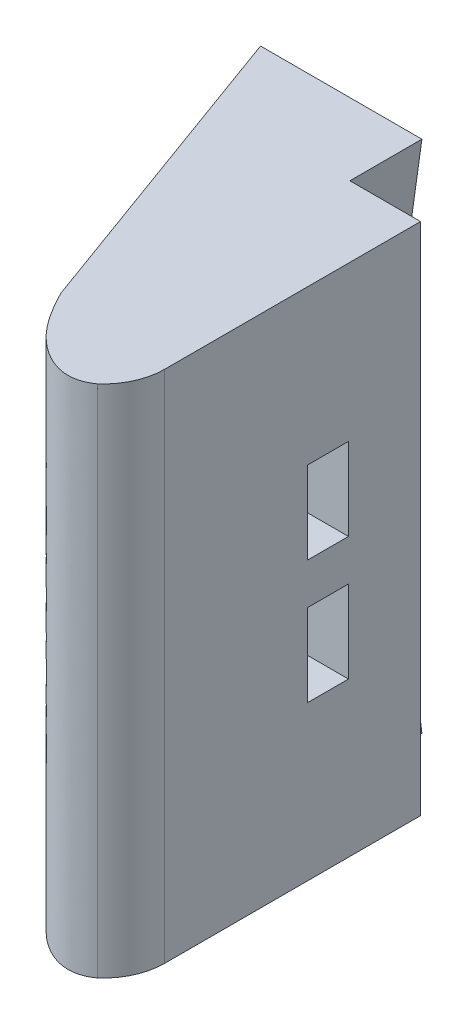
ISO-10303-21;
HEADER;
FILE_DESCRIPTION(('STEP AP214'),'2;1');
FILE_NAME('part.step','',(''),(''),'','','');
FILE_SCHEMA(('AUTOMOTIVE_DESIGN { 1 0 10303 214 1 1 1 1 }'));
ENDSEC;
DATA;
#1=APPLICATION_CONTEXT('core data for automotive mechanical design processes');
#2=APPLICATION_PROTOCOL_DEFINITION('international standard','automotive_design',2000,#1);
#3=PRODUCT_CONTEXT('',#1,'mechanical');
#4=PRODUCT('Part','Part','',(#3));
#5=PRODUCT_RELATED_PRODUCT_CATEGORY('part','',(#4));
#6=PRODUCT_DEFINITION_FORMATION('','',#4);
#7=PRODUCT_DEFINITION_CONTEXT('part definition',#1,'design');
#8=PRODUCT_DEFINITION('design','',#6,#7);
#9=PRODUCT_DEFINITION_SHAPE('','',#8);
#10=(LENGTH_UNIT() NAMED_UNIT(*) SI_UNIT(.MILLI.,.METRE.));
#11=(NAMED_UNIT(*) PLANE_ANGLE_UNIT() SI_UNIT($,.RADIAN.));
#12=(NAMED_UNIT(*) SI_UNIT($,.STERADIAN.) SOLID_ANGLE_UNIT());
#13=UNCERTAINTY_MEASURE_WITH_UNIT(LENGTH_MEASURE(1.E-05),#10,'distance_accuracy_value','');
#14=(GEOMETRIC_REPRESENTATION_CONTEXT(3) GLOBAL_UNCERTAINTY_ASSIGNED_CONTEXT((#13)) GLOBAL_UNIT_ASSIGNED_CONTEXT((#10,
#11,#12)) REPRESENTATION_CONTEXT('',''));
#15=CARTESIAN_POINT('',(0.,0.,0.));
#16=DIRECTION('',(0.,0.,1.));
#17=DIRECTION('',(1.,0.,0.));
#18=AXIS2_PLACEMENT_3D('',#15,#16,#17);
#19=CARTESIAN_POINT('',(0.,50.,0.));
#20=DIRECTION('',(0.,0.,-1.));
#21=DIRECTION('',(-1.,0.,0.));
#22=AXIS2_PLACEMENT_3D('',#19,#20,#21);
#23=PLANE('',#22);
#24=CARTESIAN_POINT('',(14.,31.,0.));
#25=DIRECTION('',(0.,0.,-1.));
#26=DIRECTION('',(-1.,0.,0.));
#27=AXIS2_PLACEMENT_3D('',#24,#25,#26);
#28=CIRCLE('',#27,1.6);
#29=CARTESIAN_POINT('',(12.4,31.,0.));
#30=VERTEX_POINT('',#29);
#31=EDGE_CURVE('E300',#30,#30,#28,.T.);
#32=ORIENTED_EDGE('',*,*,#31,.F.);
#33=EDGE_LOOP('',(#32));
#34=FACE_BOUND('',#33,.T.);
#35=CARTESIAN_POINT('',(14.,19.,0.));
#36=DIRECTION('',(0.,0.,-1.));
#37=DIRECTION('',(1.,0.,0.));
#38=AXIS2_PLACEMENT_3D('',#35,#36,#37);
#39=CIRCLE('',#38,1.6);
#40=CARTESIAN_POINT('',(15.6,19.,0.));
#41=VERTEX_POINT('',#40);
#42=EDGE_CURVE('E306',#41,#41,#39,.T.);
#43=ORIENTED_EDGE('',*,*,#42,.F.);
#44=EDGE_LOOP('',(#43));
#45=FACE_BOUND('',#44,.T.);
#46=DIRECTION('',(0.,-1.,0.));
#47=VECTOR('',#46,1.);
#48=CARTESIAN_POINT('',(0.,50.,0.));
#49=LINE('',#48,#47);
#50=CARTESIAN_POINT('',(0.,37.4287142658096,0.));
#51=VERTEX_POINT('',#50);
#52=CARTESIAN_POINT('',(0.,12.5712857341904,0.));
#53=VERTEX_POINT('',#52);
#54=EDGE_CURVE('E205',#51,#53,#49,.T.);
#55=ORIENTED_EDGE('',*,*,#54,.F.);
#56=DIRECTION('',(-1.,0.,0.));
#57=VECTOR('',#56,1.);
#58=CARTESIAN_POINT('',(0.,37.4287142658096,0.));
#59=LINE('',#58,#57);
#60=CARTESIAN_POINT('',(11.3691003651649,37.4287142658096,0.));
#61=VERTEX_POINT('',#60);
#62=EDGE_CURVE('E61',#61,#51,#59,.T.);
#63=ORIENTED_EDGE('',*,*,#62,.F.);
#64=DIRECTION('',(-0.139173100960059,-0.990268068741571,0.));
#65=VECTOR('',#64,1.);
#66=CARTESIAN_POINT('',(11.3691003651649,37.4287142658096,0.));
#67=LINE('',#66,#65);
#68=CARTESIAN_POINT('',(13.1358793555302,50.,0.));
#69=VERTEX_POINT('',#68);
#70=EDGE_CURVE('E449',#69,#61,#67,.T.);
#71=ORIENTED_EDGE('',*,*,#70,.F.);
#72=DIRECTION('',(1.,0.,0.));
#73=VECTOR('',#72,1.);
#74=CARTESIAN_POINT('',(0.,50.,0.));
#75=LINE('',#74,#73);
#76=CARTESIAN_POINT('',(20.,50.,0.));
#77=VERTEX_POINT('',#76);
#78=EDGE_CURVE('E324',#69,#77,#75,.T.);
#79=ORIENTED_EDGE('',*,*,#78,.T.);
#80=DIRECTION('',(0.,-1.,0.));
#81=VECTOR('',#80,1.);
#82=CARTESIAN_POINT('',(20.,50.,0.));
#83=LINE('',#82,#81);
#84=CARTESIAN_POINT('',(20.,0.,0.));
#85=VERTEX_POINT('',#84);
#86=EDGE_CURVE('E348',#77,#85,#83,.T.);
#87=ORIENTED_EDGE('',*,*,#86,.T.);
#88=DIRECTION('',(1.,0.,0.));
#89=VECTOR('',#88,1.);
#90=CARTESIAN_POINT('',(0.,0.,0.));
#91=LINE('',#90,#89);
#92=CARTESIAN_POINT('',(13.1358793555302,0.,0.));
#93=VERTEX_POINT('',#92);
#94=EDGE_CURVE('E342',#93,#85,#91,.T.);
#95=ORIENTED_EDGE('',*,*,#94,.F.);
#96=DIRECTION('',(0.139173100960073,-0.990268068741569,0.));
#97=VECTOR('',#96,1.);
#98=CARTESIAN_POINT('',(12.7608313747655,2.66860504677466,0.));
#99=LINE('',#98,#97);
#100=CARTESIAN_POINT('',(11.3691003651649,12.5712857341904,0.));
#101=VERTEX_POINT('',#100);
#102=EDGE_CURVE('E211',#101,#93,#99,.T.);
#103=ORIENTED_EDGE('',*,*,#102,.F.);
#104=DIRECTION('',(1.,0.,0.));
#105=VECTOR('',#104,1.);
#106=CARTESIAN_POINT('',(0.,12.5712857341904,0.));
#107=LINE('',#106,#105);
#108=EDGE_CURVE('E207',#53,#101,#107,.T.);
#109=ORIENTED_EDGE('',*,*,#108,.F.);
#110=EDGE_LOOP('',(#55,#63,#71,#79,#87,#95,#103,#109));
#111=FACE_BOUND('',#110,.T.);
#112=ADVANCED_FACE('F35',(#34,#45,#111),#23,.T.);
#113=CARTESIAN_POINT('',(14.,19.,20.));
#114=DIRECTION('',(0.,0.,-1.));
#115=DIRECTION('',(-1.,0.,0.));
#116=AXIS2_PLACEMENT_3D('',#113,#114,#115);
#117=CYLINDRICAL_SURFACE('',#116,1.6);
#118=CARTESIAN_POINT('',(14.,19.,7.));
#119=DIRECTION('',(0.,0.,-1.));
#120=DIRECTION('',(-1.,0.,0.));
#121=AXIS2_PLACEMENT_3D('',#118,#119,#120);
#122=CIRCLE('',#121,1.6);
#123=CARTESIAN_POINT('',(12.4,19.,7.));
#124=VERTEX_POINT('',#123);
#125=EDGE_CURVE('E40',#124,#124,#122,.F.);
#126=ORIENTED_EDGE('',*,*,#125,.T.);
#127=EDGE_LOOP('',(#126));
#128=FACE_BOUND('',#127,.T.);
#129=ORIENTED_EDGE('',*,*,#42,.T.);
#130=EDGE_LOOP('',(#129));
#131=FACE_BOUND('',#130,.T.);
#132=ADVANCED_FACE('F363',(#128,#131),#117,.F.);
#133=CARTESIAN_POINT('',(14.,31.,20.));
#134=DIRECTION('',(0.,0.,-1.));
#135=DIRECTION('',(-1.,0.,0.));
#136=AXIS2_PLACEMENT_3D('',#133,#134,#135);
#137=CYLINDRICAL_SURFACE('',#136,1.6);
#138=CARTESIAN_POINT('',(14.,31.,7.));
#139=DIRECTION('',(0.,0.,-1.));
#140=DIRECTION('',(-1.,0.,0.));
#141=AXIS2_PLACEMENT_3D('',#138,#139,#140);
#142=CIRCLE('',#141,1.6);
#143=CARTESIAN_POINT('',(12.4,31.,7.));
#144=VERTEX_POINT('',#143);
#145=EDGE_CURVE('E354',#144,#144,#142,.F.);
#146=ORIENTED_EDGE('',*,*,#145,.T.);
#147=EDGE_LOOP('',(#146));
#148=FACE_BOUND('',#147,.T.);
#149=ORIENTED_EDGE('',*,*,#31,.T.);
#150=EDGE_LOOP('',(#149));
#151=FACE_BOUND('',#150,.T.);
#152=ADVANCED_FACE('F390',(#148,#151),#137,.F.);
#153=CARTESIAN_POINT('',(17.9735954047257,50.,29.3468038901052));
#154=CARTESIAN_POINT('',(16.281120610665,50.,30.6016749504074));
#155=CARTESIAN_POINT('',(11.8763529202722,50.,29.3199048218283));
#156=CARTESIAN_POINT('',(9.5982313957707,50.,25.5615951303054));
#157=CARTESIAN_POINT('',(8.55050358314165,50.,23.4923155196477));
#158=B_SPLINE_CURVE_WITH_KNOTS('',3,(#153,#154,#155,#156,#157),.UNSPECIFIED.,.F.,.F.,(4,1,4),
(0.,0.430742710905784,1.),.UNSPECIFIED.);
#159=DIRECTION('',(0.,-1.,0.));
#160=VECTOR('',#159,1.);
#161=SURFACE_OF_LINEAR_EXTRUSION('',#158,#160);
#162=CARTESIAN_POINT('',(17.9735954047257,0.,29.3468038901052));
#163=CARTESIAN_POINT('',(16.281120610665,0.,30.6016749504074));
#164=CARTESIAN_POINT('',(11.8763529202722,0.,29.3199048218283));
#165=CARTESIAN_POINT('',(9.5982313957707,0.,25.5615951303054));
#166=CARTESIAN_POINT('',(8.55050358314165,0.,23.4923155196477));
#167=B_SPLINE_CURVE_WITH_KNOTS('',3,(#162,#163,#164,#165,#166),.UNSPECIFIED.,.F.,.F.,(4,1,4),
(0.,0.430742710905784,1.),.UNSPECIFIED.);
#168=CARTESIAN_POINT('',(17.9735954047257,0.,29.3468038901052));
#169=VERTEX_POINT('',#168);
#170=CARTESIAN_POINT('',(8.55050358314165,0.,23.4923155196477));
#171=VERTEX_POINT('',#170);
#172=EDGE_CURVE('E299',#169,#171,#167,.T.);
#173=ORIENTED_EDGE('',*,*,#172,.F.);
#174=DIRECTION('',(0.,-1.,0.));
#175=VECTOR('',#174,1.);
#176=CARTESIAN_POINT('',(17.9735954047257,50.,29.3468038901052));
#177=LINE('',#176,#175);
#178=CARTESIAN_POINT('',(17.9735954047257,50.,29.3468038901052));
#179=VERTEX_POINT('',#178);
#180=EDGE_CURVE('E11',#179,#169,#177,.T.);
#181=ORIENTED_EDGE('',*,*,#180,.F.);
#182=CARTESIAN_POINT('',(8.55050358314165,50.,23.4923155196477));
#183=VERTEX_POINT('',#182);
#184=EDGE_CURVE('E308',#179,#183,#158,.T.);
#185=ORIENTED_EDGE('',*,*,#184,.T.);
#186=DIRECTION('',(0.,-1.,0.));
#187=VECTOR('',#186,1.);
#188=CARTESIAN_POINT('',(8.55050358314165,50.,23.4923155196477));
#189=LINE('',#188,#187);
#190=EDGE_CURVE('E328',#183,#171,#189,.T.);
#191=ORIENTED_EDGE('',*,*,#190,.T.);
#192=EDGE_LOOP('',(#173,#181,#185,#191));
#193=FACE_BOUND('',#192,.T.);
#194=ADVANCED_FACE('F37',(#193),#161,.T.);
#195=CARTESIAN_POINT('',(14.01,50.,24.8557002988219));
#196=DIRECTION('',(0.,-1.,0.));
#197=DIRECTION('',(0.,0.,-1.));
#198=AXIS2_PLACEMENT_3D('',#195,#196,#197);
#199=CYLINDRICAL_SURFACE('',#198,5.99);
#200=CARTESIAN_POINT('',(14.01,0.,24.8557002988219));
#201=DIRECTION('',(0.,1.,0.));
#202=DIRECTION('',(0.,0.,1.));
#203=AXIS2_PLACEMENT_3D('',#200,#201,#202);
#204=CIRCLE('',#203,5.99);
#205=CARTESIAN_POINT('',(20.,0.,24.8557002988219));
#206=VERTEX_POINT('',#205);
#207=EDGE_CURVE('E333',#206,#169,#204,.F.);
#208=ORIENTED_EDGE('',*,*,#207,.F.);
#209=DIRECTION('',(0.,-1.,0.));
#210=VECTOR('',#209,1.);
#211=CARTESIAN_POINT('',(20.,50.,24.8557002988219));
#212=LINE('',#211,#210);
#213=CARTESIAN_POINT('',(20.,50.,24.8557002988219));
#214=VERTEX_POINT('',#213);
#215=EDGE_CURVE('E45',#214,#206,#212,.T.);
#216=ORIENTED_EDGE('',*,*,#215,.F.);
#217=CARTESIAN_POINT('',(14.01,50.,24.8557002988219));
#218=DIRECTION('',(0.,1.,0.));
#219=DIRECTION('',(0.,0.,1.));
#220=AXIS2_PLACEMENT_3D('',#217,#218,#219);
#221=CIRCLE('',#220,5.99);
#222=EDGE_CURVE('E314',#214,#179,#221,.F.);
#223=ORIENTED_EDGE('',*,*,#222,.T.);
#224=ORIENTED_EDGE('',*,*,#180,.T.);
#225=EDGE_LOOP('',(#208,#216,#223,#224));
#226=FACE_BOUND('',#225,.T.);
#227=ADVANCED_FACE('F400',(#226),#199,.T.);
#228=CARTESIAN_POINT('',(20.,50.,0.));
#229=DIRECTION('',(1.,0.,0.));
#230=DIRECTION('',(0.,0.,-1.));
#231=AXIS2_PLACEMENT_3D('',#228,#229,#230);
#232=PLANE('',#231);
#233=DIRECTION('',(0.,1.,0.));
#234=VECTOR('',#233,1.);
#235=CARTESIAN_POINT('',(20.,27.,7.));
#236=LINE('',#235,#234);
#237=CARTESIAN_POINT('',(20.,27.,7.));
#238=VERTEX_POINT('',#237);
#239=CARTESIAN_POINT('',(20.,35.,7.));
#240=VERTEX_POINT('',#239);
#241=EDGE_CURVE('E246',#238,#240,#236,.T.);
#242=ORIENTED_EDGE('',*,*,#241,.F.);
#243=DIRECTION('',(0.,0.,-1.));
#244=VECTOR('',#243,1.);
#245=CARTESIAN_POINT('',(20.,27.,7.));
#246=LINE('',#245,#244);
#247=CARTESIAN_POINT('',(20.,27.,11.));
#248=VERTEX_POINT('',#247);
#249=EDGE_CURVE('E236',#248,#238,#246,.T.);
#250=ORIENTED_EDGE('',*,*,#249,.F.);
#251=DIRECTION('',(0.,-1.,0.));
#252=VECTOR('',#251,1.);
#253=CARTESIAN_POINT('',(20.,27.,11.));
#254=LINE('',#253,#252);
#255=CARTESIAN_POINT('',(20.,35.,11.));
#256=VERTEX_POINT('',#255);
#257=EDGE_CURVE('E252',#256,#248,#254,.T.);
#258=ORIENTED_EDGE('',*,*,#257,.F.);
#259=DIRECTION('',(0.,0.,1.));
#260=VECTOR('',#259,1.);
#261=CARTESIAN_POINT('',(20.,35.,7.));
#262=LINE('',#261,#260);
#263=EDGE_CURVE('E248',#240,#256,#262,.T.);
#264=ORIENTED_EDGE('',*,*,#263,.F.);
#265=EDGE_LOOP('',(#242,#250,#258,#264));
#266=FACE_BOUND('',#265,.T.);
#267=DIRECTION('',(0.,1.,0.));
#268=VECTOR('',#267,1.);
#269=CARTESIAN_POINT('',(20.,23.,7.));
#270=LINE('',#269,#268);
#271=CARTESIAN_POINT('',(20.,15.,7.));
#272=VERTEX_POINT('',#271);
#273=CARTESIAN_POINT('',(20.,23.,7.));
#274=VERTEX_POINT('',#273);
#275=EDGE_CURVE('E231',#272,#274,#270,.T.);
#276=ORIENTED_EDGE('',*,*,#275,.F.);
#277=DIRECTION('',(0.,0.,-1.));
#278=VECTOR('',#277,1.);
#279=CARTESIAN_POINT('',(20.,15.,7.));
#280=LINE('',#279,#278);
#281=CARTESIAN_POINT('',(20.,15.,11.));
#282=VERTEX_POINT('',#281);
#283=EDGE_CURVE('E270',#282,#272,#280,.T.);
#284=ORIENTED_EDGE('',*,*,#283,.F.);
#285=DIRECTION('',(0.,-1.,0.));
#286=VECTOR('',#285,1.);
#287=CARTESIAN_POINT('',(20.,23.,11.));
#288=LINE('',#287,#286);
#289=CARTESIAN_POINT('',(20.,23.,11.));
#290=VERTEX_POINT('',#289);
#291=EDGE_CURVE('E284',#290,#282,#288,.T.);
#292=ORIENTED_EDGE('',*,*,#291,.F.);
#293=DIRECTION('',(0.,0.,1.));
#294=VECTOR('',#293,1.);
#295=CARTESIAN_POINT('',(20.,23.,7.));
#296=LINE('',#295,#294);
#297=EDGE_CURVE('E281',#274,#290,#296,.T.);
#298=ORIENTED_EDGE('',*,*,#297,.F.);
#299=EDGE_LOOP('',(#276,#284,#292,#298));
#300=FACE_BOUND('',#299,.T.);
#301=DIRECTION('',(0.,0.,1.));
#302=VECTOR('',#301,1.);
#303=CARTESIAN_POINT('',(20.,0.,0.));
#304=LINE('',#303,#302);
#305=EDGE_CURVE('E339',#85,#206,#304,.T.);
#306=ORIENTED_EDGE('',*,*,#305,.F.);
#307=ORIENTED_EDGE('',*,*,#86,.F.);
#308=DIRECTION('',(0.,0.,1.));
#309=VECTOR('',#308,1.);
#310=CARTESIAN_POINT('',(20.,50.,0.));
#311=LINE('',#310,#309);
#312=EDGE_CURVE('E321',#77,#214,#311,.T.);
#313=ORIENTED_EDGE('',*,*,#312,.T.);
#314=ORIENTED_EDGE('',*,*,#215,.T.);
#315=EDGE_LOOP('',(#306,#307,#313,#314));
#316=FACE_BOUND('',#315,.T.);
#317=ADVANCED_FACE('F398',(#266,#300,#316),#232,.T.);
#318=CARTESIAN_POINT('',(0.,50.,0.));
#319=DIRECTION('',(0.939692620785909,0.,-0.342020143325666));
#320=DIRECTION('',(-0.342020143325666,0.,-0.93969262078591));
#321=AXIS2_PLACEMENT_3D('',#318,#319,#320);
#322=PLANE('',#321);
#323=DIRECTION('',(0.342020143325666,0.,0.93969262078591));
#324=VECTOR('',#323,1.);
#325=CARTESIAN_POINT('',(0.,0.,0.));
#326=LINE('',#325,#324);
#327=CARTESIAN_POINT('',(-2.54779163986337,0.,-7.));
#328=VERTEX_POINT('',#327);
#329=EDGE_CURVE('E315',#328,#171,#326,.T.);
#330=ORIENTED_EDGE('',*,*,#329,.T.);
#331=ORIENTED_EDGE('',*,*,#190,.F.);
#332=DIRECTION('',(0.342020143325666,0.,0.93969262078591));
#333=VECTOR('',#332,1.);
#334=CARTESIAN_POINT('',(0.,50.,0.));
#335=LINE('',#334,#333);
#336=CARTESIAN_POINT('',(-2.54779163986337,50.,-7.));
#337=VERTEX_POINT('',#336);
#338=EDGE_CURVE('E326',#337,#183,#335,.T.);
#339=ORIENTED_EDGE('',*,*,#338,.F.);
#340=DIRECTION('',(0.,1.,0.));
#341=VECTOR('',#340,1.);
#342=CARTESIAN_POINT('',(-2.54779163986337,37.43,-7.));
#343=LINE('',#342,#341);
#344=CARTESIAN_POINT('',(-2.54779163986337,37.43,-7.));
#345=VERTEX_POINT('',#344);
#346=EDGE_CURVE('E442',#345,#337,#343,.T.);
#347=ORIENTED_EDGE('',*,*,#346,.F.);
#348=DIRECTION('',(0.342020143325663,0.,0.939692620785911));
#349=VECTOR('',#348,1.);
#350=CARTESIAN_POINT('',(-2.54779163986337,37.43,-7.));
#351=LINE('',#350,#349);
#352=CARTESIAN_POINT('',(0.,37.43,0.));
#353=VERTEX_POINT('',#352);
#354=EDGE_CURVE('E430',#345,#353,#351,.T.);
#355=ORIENTED_EDGE('',*,*,#354,.T.);
#356=EDGE_CURVE('E346',#353,#51,#49,.T.);
#357=ORIENTED_EDGE('',*,*,#356,.T.);
#358=ORIENTED_EDGE('',*,*,#54,.T.);
#359=DIRECTION('',(0.,1.,0.));
#360=VECTOR('',#359,1.);
#361=CARTESIAN_POINT('',(0.,0.,0.));
#362=LINE('',#361,#360);
#363=CARTESIAN_POINT('',(0.,12.57,0.));
#364=VERTEX_POINT('',#363);
#365=EDGE_CURVE('E199',#364,#53,#362,.T.);
#366=ORIENTED_EDGE('',*,*,#365,.F.);
#367=DIRECTION('',(-0.342020143325665,0.,-0.93969262078591));
#368=VECTOR('',#367,1.);
#369=CARTESIAN_POINT('',(0.,12.57,0.));
#370=LINE('',#369,#368);
#371=CARTESIAN_POINT('',(-2.54779163986337,12.57,-7.));
#372=VERTEX_POINT('',#371);
#373=EDGE_CURVE('E187',#364,#372,#370,.T.);
#374=ORIENTED_EDGE('',*,*,#373,.T.);
#375=DIRECTION('',(0.,-1.,0.));
#376=VECTOR('',#375,1.);
#377=CARTESIAN_POINT('',(-2.54779163986337,12.57,-7.));
#378=LINE('',#377,#376);
#379=EDGE_CURVE('E426',#372,#328,#378,.T.);
#380=ORIENTED_EDGE('',*,*,#379,.T.);
#381=EDGE_LOOP('',(#330,#331,#339,#347,#355,#357,#358,#366,#374,#380));
#382=FACE_BOUND('',#381,.T.);
#383=ADVANCED_FACE('F204',(#382),#322,.F.);
#384=CARTESIAN_POINT('',(0.,50.,0.));
#385=DIRECTION('',(0.,1.,0.));
#386=DIRECTION('',(0.,0.,1.));
#387=AXIS2_PLACEMENT_3D('',#384,#385,#386);
#388=PLANE('',#387);
#389=ORIENTED_EDGE('',*,*,#184,.F.);
#390=ORIENTED_EDGE('',*,*,#222,.F.);
#391=ORIENTED_EDGE('',*,*,#312,.F.);
#392=ORIENTED_EDGE('',*,*,#78,.F.);
#393=DIRECTION('',(0.,0.,1.));
#394=VECTOR('',#393,1.);
#395=CARTESIAN_POINT('',(13.1358793555302,50.,-7.));
#396=LINE('',#395,#394);
#397=CARTESIAN_POINT('',(13.1358793555302,50.,-7.));
#398=VERTEX_POINT('',#397);
#399=EDGE_CURVE('E214',#398,#69,#396,.T.);
#400=ORIENTED_EDGE('',*,*,#399,.F.);
#401=DIRECTION('',(1.,0.,0.));
#402=VECTOR('',#401,1.);
#403=CARTESIAN_POINT('',(13.1358793555302,50.,-7.));
#404=LINE('',#403,#402);
#405=EDGE_CURVE('E452',#337,#398,#404,.T.);
#406=ORIENTED_EDGE('',*,*,#405,.F.);
#407=ORIENTED_EDGE('',*,*,#338,.T.);
#408=EDGE_LOOP('',(#389,#390,#391,#392,#400,#406,#407));
#409=FACE_BOUND('',#408,.T.);
#410=ADVANCED_FACE('F419',(#409),#388,.T.);
#411=CARTESIAN_POINT('',(0.,0.,0.));
#412=DIRECTION('',(0.,1.,0.));
#413=DIRECTION('',(0.,0.,1.));
#414=AXIS2_PLACEMENT_3D('',#411,#412,#413);
#415=PLANE('',#414);
#416=ORIENTED_EDGE('',*,*,#172,.T.);
#417=ORIENTED_EDGE('',*,*,#329,.F.);
#418=DIRECTION('',(-1.,0.,0.));
#419=VECTOR('',#418,1.);
#420=CARTESIAN_POINT('',(13.1358793555302,0.,-7.));
#421=LINE('',#420,#419);
#422=CARTESIAN_POINT('',(13.1358793555302,0.,-7.));
#423=VERTEX_POINT('',#422);
#424=EDGE_CURVE('E217',#423,#328,#421,.T.);
#425=ORIENTED_EDGE('',*,*,#424,.F.);
#426=DIRECTION('',(0.,0.,1.));
#427=VECTOR('',#426,1.);
#428=CARTESIAN_POINT('',(13.1358793555302,0.,-7.));
#429=LINE('',#428,#427);
#430=EDGE_CURVE('E222',#423,#93,#429,.T.);
#431=ORIENTED_EDGE('',*,*,#430,.T.);
#432=ORIENTED_EDGE('',*,*,#94,.T.);
#433=ORIENTED_EDGE('',*,*,#305,.T.);
#434=ORIENTED_EDGE('',*,*,#207,.T.);
#435=EDGE_LOOP('',(#416,#417,#425,#431,#432,#433,#434));
#436=FACE_BOUND('',#435,.T.);
#437=ADVANCED_FACE('F413',(#436),#415,.F.);
#438=CARTESIAN_POINT('',(8.,27.,7.));
#439=DIRECTION('',(0.,0.,-1.));
#440=DIRECTION('',(-1.,0.,0.));
#441=AXIS2_PLACEMENT_3D('',#438,#439,#440);
#442=PLANE('',#441);
#443=ORIENTED_EDGE('',*,*,#241,.T.);
#444=DIRECTION('',(1.,0.,0.));
#445=VECTOR('',#444,1.);
#446=CARTESIAN_POINT('',(8.,35.,7.));
#447=LINE('',#446,#445);
#448=CARTESIAN_POINT('',(8.,35.,7.));
#449=VERTEX_POINT('',#448);
#450=EDGE_CURVE('E245',#449,#240,#447,.T.);
#451=ORIENTED_EDGE('',*,*,#450,.F.);
#452=DIRECTION('',(0.,1.,0.));
#453=VECTOR('',#452,1.);
#454=CARTESIAN_POINT('',(8.,27.,7.));
#455=LINE('',#454,#453);
#456=CARTESIAN_POINT('',(8.,27.,7.));
#457=VERTEX_POINT('',#456);
#458=EDGE_CURVE('E232',#457,#449,#455,.T.);
#459=ORIENTED_EDGE('',*,*,#458,.F.);
#460=DIRECTION('',(1.,0.,0.));
#461=VECTOR('',#460,1.);
#462=CARTESIAN_POINT('',(8.,27.,7.));
#463=LINE('',#462,#461);
#464=EDGE_CURVE('E257',#457,#238,#463,.T.);
#465=ORIENTED_EDGE('',*,*,#464,.T.);
#466=EDGE_LOOP('',(#443,#451,#459,#465));
#467=FACE_BOUND('',#466,.T.);
#468=ORIENTED_EDGE('',*,*,#145,.F.);
#469=EDGE_LOOP('',(#468));
#470=FACE_BOUND('',#469,.T.);
#471=ADVANCED_FACE('F510',(#467,#470),#442,.F.);
#472=CARTESIAN_POINT('',(8.,27.,11.));
#473=DIRECTION('',(0.,0.,1.));
#474=DIRECTION('',(1.,0.,0.));
#475=AXIS2_PLACEMENT_3D('',#472,#473,#474);
#476=PLANE('',#475);
#477=ORIENTED_EDGE('',*,*,#257,.T.);
#478=DIRECTION('',(1.,0.,0.));
#479=VECTOR('',#478,1.);
#480=CARTESIAN_POINT('',(8.,27.,11.));
#481=LINE('',#480,#479);
#482=CARTESIAN_POINT('',(8.,27.,11.));
#483=VERTEX_POINT('',#482);
#484=EDGE_CURVE('E260',#483,#248,#481,.T.);
#485=ORIENTED_EDGE('',*,*,#484,.F.);
#486=DIRECTION('',(0.,-1.,0.));
#487=VECTOR('',#486,1.);
#488=CARTESIAN_POINT('',(8.,27.,11.));
#489=LINE('',#488,#487);
#490=CARTESIAN_POINT('',(8.,35.,11.));
#491=VERTEX_POINT('',#490);
#492=EDGE_CURVE('E239',#491,#483,#489,.T.);
#493=ORIENTED_EDGE('',*,*,#492,.F.);
#494=DIRECTION('',(1.,0.,0.));
#495=VECTOR('',#494,1.);
#496=CARTESIAN_POINT('',(8.,35.,11.));
#497=LINE('',#496,#495);
#498=EDGE_CURVE('E262',#491,#256,#497,.T.);
#499=ORIENTED_EDGE('',*,*,#498,.T.);
#500=EDGE_LOOP('',(#477,#485,#493,#499));
#501=FACE_BOUND('',#500,.T.);
#502=CARTESIAN_POINT('',(14.,31.,11.));
#503=DIRECTION('',(0.,0.,1.));
#504=DIRECTION('',(1.,0.,0.));
#505=AXIS2_PLACEMENT_3D('',#502,#503,#504);
#506=CIRCLE('',#505,1.6);
#507=CARTESIAN_POINT('',(15.6,31.,11.));
#508=VERTEX_POINT('',#507);
#509=EDGE_CURVE('E259',#508,#508,#506,.F.);
#510=ORIENTED_EDGE('',*,*,#509,.F.);
#511=EDGE_LOOP('',(#510));
#512=FACE_BOUND('',#511,.T.);
#513=ADVANCED_FACE('F506',(#501,#512),#476,.F.);
#514=CARTESIAN_POINT('',(8.,27.,7.));
#515=DIRECTION('',(0.,-1.,0.));
#516=DIRECTION('',(0.,0.,-1.));
#517=AXIS2_PLACEMENT_3D('',#514,#515,#516);
#518=PLANE('',#517);
#519=ORIENTED_EDGE('',*,*,#249,.T.);
#520=ORIENTED_EDGE('',*,*,#464,.F.);
#521=DIRECTION('',(0.,0.,-1.));
#522=VECTOR('',#521,1.);
#523=CARTESIAN_POINT('',(8.,27.,7.));
#524=LINE('',#523,#522);
#525=EDGE_CURVE('E242',#483,#457,#524,.T.);
#526=ORIENTED_EDGE('',*,*,#525,.F.);
#527=ORIENTED_EDGE('',*,*,#484,.T.);
#528=EDGE_LOOP('',(#519,#520,#526,#527));
#529=FACE_BOUND('',#528,.T.);
#530=ADVANCED_FACE('F503',(#529),#518,.F.);
#531=CARTESIAN_POINT('',(8.,35.,7.));
#532=DIRECTION('',(0.,1.,0.));
#533=DIRECTION('',(0.,0.,1.));
#534=AXIS2_PLACEMENT_3D('',#531,#532,#533);
#535=PLANE('',#534);
#536=ORIENTED_EDGE('',*,*,#263,.T.);
#537=ORIENTED_EDGE('',*,*,#498,.F.);
#538=DIRECTION('',(0.,0.,1.));
#539=VECTOR('',#538,1.);
#540=CARTESIAN_POINT('',(8.,35.,7.));
#541=LINE('',#540,#539);
#542=EDGE_CURVE('E235',#449,#491,#541,.T.);
#543=ORIENTED_EDGE('',*,*,#542,.F.);
#544=ORIENTED_EDGE('',*,*,#450,.T.);
#545=EDGE_LOOP('',(#536,#537,#543,#544));
#546=FACE_BOUND('',#545,.T.);
#547=ADVANCED_FACE('F379',(#546),#535,.F.);
#548=CARTESIAN_POINT('',(8.,0.,0.));
#549=DIRECTION('',(1.,0.,0.));
#550=DIRECTION('',(0.,0.,-1.));
#551=AXIS2_PLACEMENT_3D('',#548,#549,#550);
#552=PLANE('',#551);
#553=ORIENTED_EDGE('',*,*,#458,.T.);
#554=ORIENTED_EDGE('',*,*,#542,.T.);
#555=ORIENTED_EDGE('',*,*,#492,.T.);
#556=ORIENTED_EDGE('',*,*,#525,.T.);
#557=EDGE_LOOP('',(#553,#554,#555,#556));
#558=FACE_BOUND('',#557,.T.);
#559=ADVANCED_FACE('F369',(#558),#552,.T.);
#560=CARTESIAN_POINT('',(8.,23.,7.));
#561=DIRECTION('',(0.,0.,-1.));
#562=DIRECTION('',(-1.,0.,0.));
#563=AXIS2_PLACEMENT_3D('',#560,#561,#562);
#564=PLANE('',#563);
#565=ORIENTED_EDGE('',*,*,#275,.T.);
#566=DIRECTION('',(1.,0.,0.));
#567=VECTOR('',#566,1.);
#568=CARTESIAN_POINT('',(8.,23.,7.));
#569=LINE('',#568,#567);
#570=CARTESIAN_POINT('',(8.,23.,7.));
#571=VERTEX_POINT('',#570);
#572=EDGE_CURVE('E279',#571,#274,#569,.T.);
#573=ORIENTED_EDGE('',*,*,#572,.F.);
#574=DIRECTION('',(0.,1.,0.));
#575=VECTOR('',#574,1.);
#576=CARTESIAN_POINT('',(8.,23.,7.));
#577=LINE('',#576,#575);
#578=CARTESIAN_POINT('',(8.,15.,7.));
#579=VERTEX_POINT('',#578);
#580=EDGE_CURVE('E266',#579,#571,#577,.T.);
#581=ORIENTED_EDGE('',*,*,#580,.F.);
#582=DIRECTION('',(1.,0.,0.));
#583=VECTOR('',#582,1.);
#584=CARTESIAN_POINT('',(8.,15.,7.));
#585=LINE('',#584,#583);
#586=EDGE_CURVE('E249',#579,#272,#585,.T.);
#587=ORIENTED_EDGE('',*,*,#586,.T.);
#588=EDGE_LOOP('',(#565,#573,#581,#587));
#589=FACE_BOUND('',#588,.T.);
#590=ORIENTED_EDGE('',*,*,#125,.F.);
#591=EDGE_LOOP('',(#590));
#592=FACE_BOUND('',#591,.T.);
#593=ADVANCED_FACE('F366',(#589,#592),#564,.F.);
#594=CARTESIAN_POINT('',(8.,23.,11.));
#595=DIRECTION('',(0.,0.,1.));
#596=DIRECTION('',(1.,0.,0.));
#597=AXIS2_PLACEMENT_3D('',#594,#595,#596);
#598=PLANE('',#597);
#599=ORIENTED_EDGE('',*,*,#291,.T.);
#600=DIRECTION('',(1.,0.,0.));
#601=VECTOR('',#600,1.);
#602=CARTESIAN_POINT('',(8.,15.,11.));
#603=LINE('',#602,#601);
#604=CARTESIAN_POINT('',(8.,15.,11.));
#605=VERTEX_POINT('',#604);
#606=EDGE_CURVE('E290',#605,#282,#603,.T.);
#607=ORIENTED_EDGE('',*,*,#606,.F.);
#608=DIRECTION('',(0.,-1.,0.));
#609=VECTOR('',#608,1.);
#610=CARTESIAN_POINT('',(8.,23.,11.));
#611=LINE('',#610,#609);
#612=CARTESIAN_POINT('',(8.,23.,11.));
#613=VERTEX_POINT('',#612);
#614=EDGE_CURVE('E273',#613,#605,#611,.T.);
#615=ORIENTED_EDGE('',*,*,#614,.F.);
#616=DIRECTION('',(1.,0.,0.));
#617=VECTOR('',#616,1.);
#618=CARTESIAN_POINT('',(8.,23.,11.));
#619=LINE('',#618,#617);
#620=EDGE_CURVE('E292',#613,#290,#619,.T.);
#621=ORIENTED_EDGE('',*,*,#620,.T.);
#622=EDGE_LOOP('',(#599,#607,#615,#621));
#623=FACE_BOUND('',#622,.T.);
#624=CARTESIAN_POINT('',(14.,19.,11.));
#625=DIRECTION('',(0.,0.,1.));
#626=DIRECTION('',(1.,0.,0.));
#627=AXIS2_PLACEMENT_3D('',#624,#625,#626);
#628=CIRCLE('',#627,1.6);
#629=CARTESIAN_POINT('',(15.6,19.,11.));
#630=VERTEX_POINT('',#629);
#631=EDGE_CURVE('E356',#630,#630,#628,.F.);
#632=ORIENTED_EDGE('',*,*,#631,.F.);
#633=EDGE_LOOP('',(#632));
#634=FACE_BOUND('',#633,.T.);
#635=ADVANCED_FACE('F368',(#623,#634),#598,.F.);
#636=CARTESIAN_POINT('',(8.,15.,7.));
#637=DIRECTION('',(0.,-1.,0.));
#638=DIRECTION('',(0.,0.,-1.));
#639=AXIS2_PLACEMENT_3D('',#636,#637,#638);
#640=PLANE('',#639);
#641=ORIENTED_EDGE('',*,*,#283,.T.);
#642=ORIENTED_EDGE('',*,*,#586,.F.);
#643=DIRECTION('',(0.,0.,-1.));
#644=VECTOR('',#643,1.);
#645=CARTESIAN_POINT('',(8.,15.,7.));
#646=LINE('',#645,#644);
#647=EDGE_CURVE('E276',#605,#579,#646,.T.);
#648=ORIENTED_EDGE('',*,*,#647,.F.);
#649=ORIENTED_EDGE('',*,*,#606,.T.);
#650=EDGE_LOOP('',(#641,#642,#648,#649));
#651=FACE_BOUND('',#650,.T.);
#652=ADVANCED_FACE('F376',(#651),#640,.F.);
#653=CARTESIAN_POINT('',(8.,23.,7.));
#654=DIRECTION('',(0.,1.,0.));
#655=DIRECTION('',(0.,0.,1.));
#656=AXIS2_PLACEMENT_3D('',#653,#654,#655);
#657=PLANE('',#656);
#658=ORIENTED_EDGE('',*,*,#297,.T.);
#659=ORIENTED_EDGE('',*,*,#620,.F.);
#660=DIRECTION('',(0.,0.,1.));
#661=VECTOR('',#660,1.);
#662=CARTESIAN_POINT('',(8.,23.,7.));
#663=LINE('',#662,#661);
#664=EDGE_CURVE('E269',#571,#613,#663,.T.);
#665=ORIENTED_EDGE('',*,*,#664,.F.);
#666=ORIENTED_EDGE('',*,*,#572,.T.);
#667=EDGE_LOOP('',(#658,#659,#665,#666));
#668=FACE_BOUND('',#667,.T.);
#669=ADVANCED_FACE('F522',(#668),#657,.F.);
#670=CARTESIAN_POINT('',(8.,0.,0.));
#671=DIRECTION('',(-1.,0.,0.));
#672=DIRECTION('',(0.,0.,1.));
#673=AXIS2_PLACEMENT_3D('',#670,#671,#672);
#674=PLANE('',#673);
#675=ORIENTED_EDGE('',*,*,#580,.T.);
#676=ORIENTED_EDGE('',*,*,#664,.T.);
#677=ORIENTED_EDGE('',*,*,#614,.T.);
#678=ORIENTED_EDGE('',*,*,#647,.T.);
#679=EDGE_LOOP('',(#675,#676,#677,#678));
#680=FACE_BOUND('',#679,.T.);
#681=ADVANCED_FACE('F518',(#680),#674,.F.);
#682=CARTESIAN_POINT('',(14.,31.,20.));
#683=DIRECTION('',(0.,0.,-1.));
#684=DIRECTION('',(-1.,0.,0.));
#685=AXIS2_PLACEMENT_3D('',#682,#683,#684);
#686=PLANE('',#685);
#687=CARTESIAN_POINT('',(14.,31.,20.));
#688=DIRECTION('',(0.,0.,-1.));
#689=DIRECTION('',(-1.,0.,0.));
#690=AXIS2_PLACEMENT_3D('',#687,#688,#689);
#691=CIRCLE('',#690,1.6);
#692=CARTESIAN_POINT('',(12.4,31.,20.));
#693=VERTEX_POINT('',#692);
#694=EDGE_CURVE('E296',#693,#693,#691,.T.);
#695=ORIENTED_EDGE('',*,*,#694,.T.);
#696=EDGE_LOOP('',(#695));
#697=FACE_BOUND('',#696,.T.);
#698=ADVANCED_FACE('F521',(#697),#686,.T.);
#699=ORIENTED_EDGE('',*,*,#509,.T.);
#700=EDGE_LOOP('',(#699));
#701=FACE_BOUND('',#700,.T.);
#702=ORIENTED_EDGE('',*,*,#694,.F.);
#703=EDGE_LOOP('',(#702));
#704=FACE_BOUND('',#703,.T.);
#705=ADVANCED_FACE('F553',(#701,#704),#137,.F.);
#706=CARTESIAN_POINT('',(14.,19.,20.));
#707=DIRECTION('',(0.,0.,1.));
#708=DIRECTION('',(1.,0.,0.));
#709=AXIS2_PLACEMENT_3D('',#706,#707,#708);
#710=PLANE('',#709);
#711=CARTESIAN_POINT('',(14.,19.,20.));
#712=DIRECTION('',(0.,0.,-1.));
#713=DIRECTION('',(1.,0.,0.));
#714=AXIS2_PLACEMENT_3D('',#711,#712,#713);
#715=CIRCLE('',#714,1.6);
#716=CARTESIAN_POINT('',(15.6,19.,20.));
#717=VERTEX_POINT('',#716);
#718=EDGE_CURVE('E303',#717,#717,#715,.T.);
#719=ORIENTED_EDGE('',*,*,#718,.T.);
#720=EDGE_LOOP('',(#719));
#721=FACE_BOUND('',#720,.T.);
#722=ADVANCED_FACE('F561',(#721),#710,.F.);
#723=ORIENTED_EDGE('',*,*,#631,.T.);
#724=EDGE_LOOP('',(#723));
#725=FACE_BOUND('',#724,.T.);
#726=ORIENTED_EDGE('',*,*,#718,.F.);
#727=EDGE_LOOP('',(#726));
#728=FACE_BOUND('',#727,.T.);
#729=ADVANCED_FACE('F392',(#725,#728),#117,.F.);
#730=CARTESIAN_POINT('',(0.,0.,-7.));
#731=DIRECTION('',(1.,0.,0.));
#732=DIRECTION('',(0.,0.,-1.));
#733=AXIS2_PLACEMENT_3D('',#730,#731,#732);
#734=PLANE('',#733);
#735=DIRECTION('',(0.,1.,0.));
#736=VECTOR('',#735,1.);
#737=CARTESIAN_POINT('',(0.,0.,-7.));
#738=LINE('',#737,#736);
#739=CARTESIAN_POINT('',(0.,12.57,-7.));
#740=VERTEX_POINT('',#739);
#741=CARTESIAN_POINT('',(0.,12.5712857341904,-7.));
#742=VERTEX_POINT('',#741);
#743=EDGE_CURVE('E201',#740,#742,#738,.T.);
#744=ORIENTED_EDGE('',*,*,#743,.F.);
#745=DIRECTION('',(0.,0.,1.));
#746=VECTOR('',#745,1.);
#747=CARTESIAN_POINT('',(0.,12.57,-7.));
#748=LINE('',#747,#746);
#749=EDGE_CURVE('E190',#740,#364,#748,.T.);
#750=ORIENTED_EDGE('',*,*,#749,.T.);
#751=ORIENTED_EDGE('',*,*,#365,.T.);
#752=DIRECTION('',(0.,0.,1.));
#753=VECTOR('',#752,1.);
#754=CARTESIAN_POINT('',(0.,12.5712857341904,-7.));
#755=LINE('',#754,#753);
#756=EDGE_CURVE('E228',#742,#53,#755,.T.);
#757=ORIENTED_EDGE('',*,*,#756,.F.);
#758=EDGE_LOOP('',(#744,#750,#751,#757));
#759=FACE_BOUND('',#758,.T.);
#760=ADVANCED_FACE('F197',(#759),#734,.F.);
#761=CARTESIAN_POINT('',(0.,12.5712857341904,-7.));
#762=DIRECTION('',(0.,-1.,0.));
#763=DIRECTION('',(0.,0.,-1.));
#764=AXIS2_PLACEMENT_3D('',#761,#762,#763);
#765=PLANE('',#764);
#766=ORIENTED_EDGE('',*,*,#108,.T.);
#767=DIRECTION('',(0.,0.,1.));
#768=VECTOR('',#767,1.);
#769=CARTESIAN_POINT('',(11.3691003651649,12.5712857341904,-7.));
#770=LINE('',#769,#768);
#771=CARTESIAN_POINT('',(11.3691003651649,12.5712857341904,-7.));
#772=VERTEX_POINT('',#771);
#773=EDGE_CURVE('E225',#772,#101,#770,.T.);
#774=ORIENTED_EDGE('',*,*,#773,.F.);
#775=DIRECTION('',(1.,0.,0.));
#776=VECTOR('',#775,1.);
#777=CARTESIAN_POINT('',(0.,12.5712857341904,-7.));
#778=LINE('',#777,#776);
#779=EDGE_CURVE('E464',#742,#772,#778,.T.);
#780=ORIENTED_EDGE('',*,*,#779,.F.);
#781=ORIENTED_EDGE('',*,*,#756,.T.);
#782=EDGE_LOOP('',(#766,#774,#780,#781));
#783=FACE_BOUND('',#782,.T.);
#784=ADVANCED_FACE('F468',(#783),#765,.F.);
#785=CARTESIAN_POINT('',(12.7608313747655,2.66860504677466,-7.));
#786=DIRECTION('',(-0.990268068741569,-0.139173100960073,0.));
#787=DIRECTION('',(0.139173100960073,-0.990268068741569,0.));
#788=AXIS2_PLACEMENT_3D('',#785,#786,#787);
#789=PLANE('',#788);
#790=ORIENTED_EDGE('',*,*,#102,.T.);
#791=ORIENTED_EDGE('',*,*,#430,.F.);
#792=DIRECTION('',(0.139173100960059,-0.990268068741571,0.));
#793=VECTOR('',#792,1.);
#794=CARTESIAN_POINT('',(11.3691003651649,12.5712857341904,-7.));
#795=LINE('',#794,#793);
#796=EDGE_CURVE('E428',#772,#423,#795,.T.);
#797=ORIENTED_EDGE('',*,*,#796,.F.);
#798=ORIENTED_EDGE('',*,*,#773,.T.);
#799=EDGE_LOOP('',(#790,#791,#797,#798));
#800=FACE_BOUND('',#799,.T.);
#801=ADVANCED_FACE('F470',(#800),#789,.F.);
#802=CARTESIAN_POINT('',(0.,0.,-7.));
#803=DIRECTION('',(0.,0.,-1.));
#804=DIRECTION('',(-1.,0.,0.));
#805=AXIS2_PLACEMENT_3D('',#802,#803,#804);
#806=PLANE('',#805);
#807=ORIENTED_EDGE('',*,*,#424,.T.);
#808=ORIENTED_EDGE('',*,*,#379,.F.);
#809=DIRECTION('',(1.,0.,0.));
#810=VECTOR('',#809,1.);
#811=CARTESIAN_POINT('',(-2.54779163986337,12.57,-7.));
#812=LINE('',#811,#810);
#813=EDGE_CURVE('E53',#372,#740,#812,.T.);
#814=ORIENTED_EDGE('',*,*,#813,.T.);
#815=ORIENTED_EDGE('',*,*,#743,.T.);
#816=ORIENTED_EDGE('',*,*,#779,.T.);
#817=ORIENTED_EDGE('',*,*,#796,.T.);
#818=EDGE_LOOP('',(#807,#808,#814,#815,#816,#817));
#819=FACE_BOUND('',#818,.T.);
#820=ADVANCED_FACE('F425',(#819),#806,.T.);
#821=CARTESIAN_POINT('',(0.,37.4287142658096,-7.));
#822=DIRECTION('',(0.,1.,0.));
#823=DIRECTION('',(0.,0.,1.));
#824=AXIS2_PLACEMENT_3D('',#821,#822,#823);
#825=PLANE('',#824);
#826=ORIENTED_EDGE('',*,*,#62,.T.);
#827=DIRECTION('',(0.,0.,1.));
#828=VECTOR('',#827,1.);
#829=CARTESIAN_POINT('',(0.,37.4287142658096,-7.));
#830=LINE('',#829,#828);
#831=CARTESIAN_POINT('',(0.,37.4287142658096,-7.));
#832=VERTEX_POINT('',#831);
#833=EDGE_CURVE('E208',#832,#51,#830,.T.);
#834=ORIENTED_EDGE('',*,*,#833,.F.);
#835=DIRECTION('',(-1.,0.,0.));
#836=VECTOR('',#835,1.);
#837=CARTESIAN_POINT('',(0.,37.4287142658096,-7.));
#838=LINE('',#837,#836);
#839=CARTESIAN_POINT('',(11.3691003651649,37.4287142658096,-7.));
#840=VERTEX_POINT('',#839);
#841=EDGE_CURVE('E445',#840,#832,#838,.T.);
#842=ORIENTED_EDGE('',*,*,#841,.F.);
#843=DIRECTION('',(0.,0.,1.));
#844=VECTOR('',#843,1.);
#845=CARTESIAN_POINT('',(11.3691003651649,37.4287142658096,-7.));
#846=LINE('',#845,#844);
#847=EDGE_CURVE('E456',#840,#61,#846,.T.);
#848=ORIENTED_EDGE('',*,*,#847,.T.);
#849=EDGE_LOOP('',(#826,#834,#842,#848));
#850=FACE_BOUND('',#849,.T.);
#851=ADVANCED_FACE('F486',(#850),#825,.F.);
#852=CARTESIAN_POINT('',(0.,50.,-7.));
#853=DIRECTION('',(1.,0.,0.));
#854=DIRECTION('',(0.,0.,-1.));
#855=AXIS2_PLACEMENT_3D('',#852,#853,#854);
#856=PLANE('',#855);
#857=ORIENTED_EDGE('',*,*,#356,.F.);
#858=DIRECTION('',(0.,0.,-1.));
#859=VECTOR('',#858,1.);
#860=CARTESIAN_POINT('',(0.,37.43,0.));
#861=LINE('',#860,#859);
#862=CARTESIAN_POINT('',(0.,37.43,-7.));
#863=VERTEX_POINT('',#862);
#864=EDGE_CURVE('E433',#353,#863,#861,.T.);
#865=ORIENTED_EDGE('',*,*,#864,.T.);
#866=DIRECTION('',(0.,1.,0.));
#867=VECTOR('',#866,1.);
#868=CARTESIAN_POINT('',(0.,50.,-7.));
#869=LINE('',#868,#867);
#870=EDGE_CURVE('E448',#832,#863,#869,.T.);
#871=ORIENTED_EDGE('',*,*,#870,.F.);
#872=ORIENTED_EDGE('',*,*,#833,.T.);
#873=EDGE_LOOP('',(#857,#865,#871,#872));
#874=FACE_BOUND('',#873,.T.);
#875=ADVANCED_FACE('F482',(#874),#856,.F.);
#876=CARTESIAN_POINT('',(11.3691003651649,37.4287142658096,-7.));
#877=DIRECTION('',(-0.990268068741571,0.139173100960059,0.));
#878=DIRECTION('',(-0.139173100960059,-0.990268068741571,0.));
#879=AXIS2_PLACEMENT_3D('',#876,#877,#878);
#880=PLANE('',#879);
#881=ORIENTED_EDGE('',*,*,#70,.T.);
#882=ORIENTED_EDGE('',*,*,#847,.F.);
#883=DIRECTION('',(-0.139173100960059,-0.990268068741571,0.));
#884=VECTOR('',#883,1.);
#885=CARTESIAN_POINT('',(12.7608313747655,47.3313949532253,-7.));
#886=LINE('',#885,#884);
#887=EDGE_CURVE('E454',#398,#840,#886,.T.);
#888=ORIENTED_EDGE('',*,*,#887,.F.);
#889=ORIENTED_EDGE('',*,*,#399,.T.);
#890=EDGE_LOOP('',(#881,#882,#888,#889));
#891=FACE_BOUND('',#890,.T.);
#892=ADVANCED_FACE('F474',(#891),#880,.F.);
#893=CARTESIAN_POINT('',(0.,0.,-7.));
#894=DIRECTION('',(0.,0.,-1.));
#895=DIRECTION('',(-1.,0.,0.));
#896=AXIS2_PLACEMENT_3D('',#893,#894,#895);
#897=PLANE('',#896);
#898=ORIENTED_EDGE('',*,*,#841,.T.);
#899=ORIENTED_EDGE('',*,*,#870,.T.);
#900=DIRECTION('',(-1.,0.,0.));
#901=VECTOR('',#900,1.);
#902=CARTESIAN_POINT('',(0.,37.43,-7.));
#903=LINE('',#902,#901);
#904=EDGE_CURVE('E439',#863,#345,#903,.T.);
#905=ORIENTED_EDGE('',*,*,#904,.T.);
#906=ORIENTED_EDGE('',*,*,#346,.T.);
#907=ORIENTED_EDGE('',*,*,#405,.T.);
#908=ORIENTED_EDGE('',*,*,#887,.T.);
#909=EDGE_LOOP('',(#898,#899,#905,#906,#907,#908));
#910=FACE_BOUND('',#909,.T.);
#911=ADVANCED_FACE('F476',(#910),#897,.T.);
#912=CARTESIAN_POINT('',(0.,37.43,0.));
#913=DIRECTION('',(0.,-1.,0.));
#914=DIRECTION('',(0.,0.,-1.));
#915=AXIS2_PLACEMENT_3D('',#912,#913,#914);
#916=PLANE('',#915);
#917=ORIENTED_EDGE('',*,*,#354,.F.);
#918=ORIENTED_EDGE('',*,*,#904,.F.);
#919=ORIENTED_EDGE('',*,*,#864,.F.);
#920=EDGE_LOOP('',(#917,#918,#919));
#921=FACE_BOUND('',#920,.T.);
#922=ADVANCED_FACE('F480',(#921),#916,.T.);
#923=CARTESIAN_POINT('',(0.,12.57,0.));
#924=DIRECTION('',(0.,1.,0.));
#925=DIRECTION('',(0.,0.,1.));
#926=AXIS2_PLACEMENT_3D('',#923,#924,#925);
#927=PLANE('',#926);
#928=ORIENTED_EDGE('',*,*,#749,.F.);
#929=ORIENTED_EDGE('',*,*,#813,.F.);
#930=ORIENTED_EDGE('',*,*,#373,.F.);
#931=EDGE_LOOP('',(#928,#929,#930));
#932=FACE_BOUND('',#931,.T.);
#933=ADVANCED_FACE('F189',(#932),#927,.T.);
#934=CLOSED_SHELL('',(#112,#132,#152,#194,#227,#317,#383,#410,#437,#471,#513,#530,#547,#559,
#593,#635,#652,#669,#681,#698,#705,#722,#729,#760,#784,#801,#820,#851,#875,#892,#911,#922,#933));
#935=MANIFOLD_SOLID_BREP('B2',#934);
#936=ADVANCED_BREP_SHAPE_REPRESENTATION('',(#18,#935),#14);
#937=SHAPE_DEFINITION_REPRESENTATION(#9,#936);
ENDSEC;
END-ISO-10303-21;
